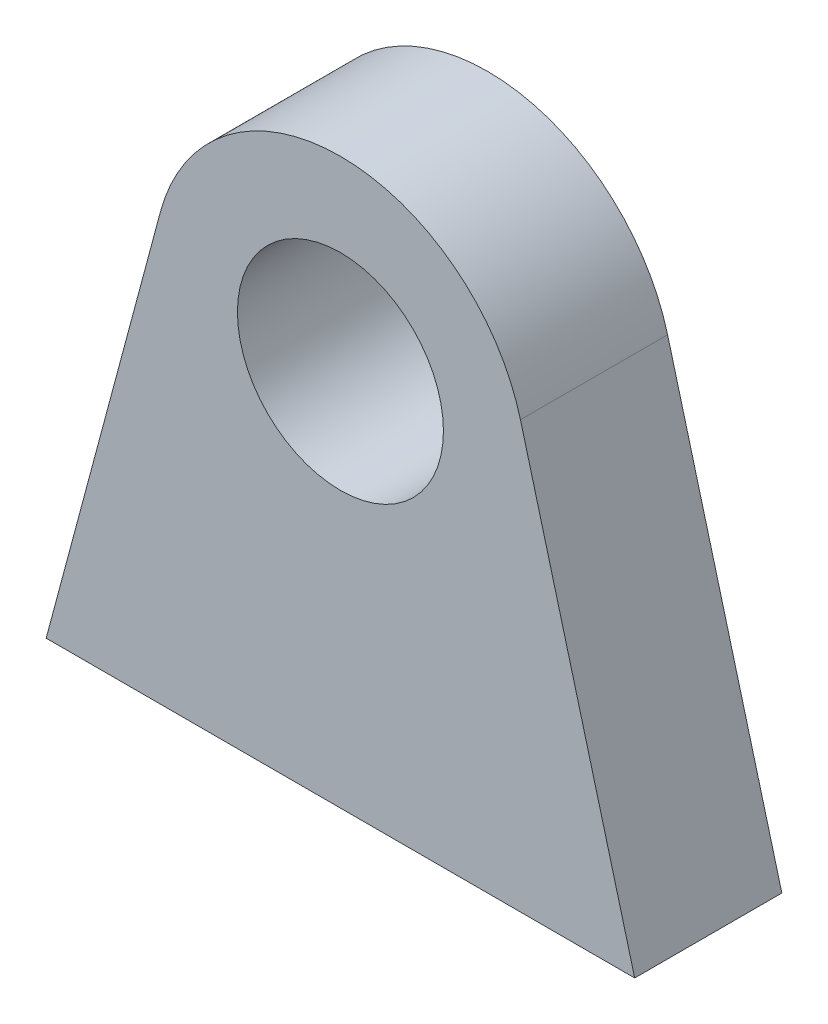
ISO-10303-21;
HEADER;
FILE_DESCRIPTION(('STEP AP214'),'2;1');
FILE_NAME('part.step','',(''),(''),'','','');
FILE_SCHEMA(('AUTOMOTIVE_DESIGN { 1 0 10303 214 1 1 1 1 }'));
ENDSEC;
DATA;
#1=APPLICATION_CONTEXT('core data for automotive mechanical design processes');
#2=APPLICATION_PROTOCOL_DEFINITION('international standard','automotive_design',2000,#1);
#3=PRODUCT_CONTEXT('',#1,'mechanical');
#4=PRODUCT('Part','Part','',(#3));
#5=PRODUCT_RELATED_PRODUCT_CATEGORY('part','',(#4));
#6=PRODUCT_DEFINITION_FORMATION('','',#4);
#7=PRODUCT_DEFINITION_CONTEXT('part definition',#1,'design');
#8=PRODUCT_DEFINITION('design','',#6,#7);
#9=PRODUCT_DEFINITION_SHAPE('','',#8);
#10=(LENGTH_UNIT() NAMED_UNIT(*) SI_UNIT(.MILLI.,.METRE.));
#11=(NAMED_UNIT(*) PLANE_ANGLE_UNIT() SI_UNIT($,.RADIAN.));
#12=(NAMED_UNIT(*) SI_UNIT($,.STERADIAN.) SOLID_ANGLE_UNIT());
#13=UNCERTAINTY_MEASURE_WITH_UNIT(LENGTH_MEASURE(1.E-05),#10,'distance_accuracy_value','');
#14=(GEOMETRIC_REPRESENTATION_CONTEXT(3) GLOBAL_UNCERTAINTY_ASSIGNED_CONTEXT((#13)) GLOBAL_UNIT_ASSIGNED_CONTEXT((#10,
#11,#12)) REPRESENTATION_CONTEXT('',''));
#15=CARTESIAN_POINT('',(0.,0.,0.));
#16=DIRECTION('',(0.,0.,1.));
#17=DIRECTION('',(1.,0.,0.));
#18=AXIS2_PLACEMENT_3D('',#15,#16,#17);
#19=CARTESIAN_POINT('',(-20.,0.,10.));
#20=DIRECTION('',(0.965925826289069,-0.258819045102518,0.));
#21=DIRECTION('',(0.258819045102518,0.965925826289069,0.));
#22=AXIS2_PLACEMENT_3D('',#19,#20,#21);
#23=PLANE('',#22);
#24=DIRECTION('',(-0.258819045102518,-0.965925826289069,0.));
#25=VECTOR('',#24,1.);
#26=CARTESIAN_POINT('',(-20.,0.,0.));
#27=LINE('',#26,#25);
#28=CARTESIAN_POINT('',(-12.2354286469245,28.9777747886721,0.));
#29=VERTEX_POINT('',#28);
#30=CARTESIAN_POINT('',(-20.,0.,0.));
#31=VERTEX_POINT('',#30);
#32=EDGE_CURVE('E112',#29,#31,#27,.T.);
#33=ORIENTED_EDGE('',*,*,#32,.T.);
#34=DIRECTION('',(0.,0.,-1.));
#35=VECTOR('',#34,1.);
#36=CARTESIAN_POINT('',(-20.,0.,10.));
#37=LINE('',#36,#35);
#38=CARTESIAN_POINT('',(-20.,0.,10.));
#39=VERTEX_POINT('',#38);
#40=EDGE_CURVE('E11',#39,#31,#37,.T.);
#41=ORIENTED_EDGE('',*,*,#40,.F.);
#42=DIRECTION('',(-0.258819045102518,-0.965925826289069,0.));
#43=VECTOR('',#42,1.);
#44=CARTESIAN_POINT('',(-20.,0.,10.));
#45=LINE('',#44,#43);
#46=CARTESIAN_POINT('',(-12.2354286469245,28.9777747886721,10.));
#47=VERTEX_POINT('',#46);
#48=EDGE_CURVE('E95',#47,#39,#45,.T.);
#49=ORIENTED_EDGE('',*,*,#48,.F.);
#50=DIRECTION('',(0.,0.,-1.));
#51=VECTOR('',#50,1.);
#52=CARTESIAN_POINT('',(-12.2354286469245,28.9777747886721,10.));
#53=LINE('',#52,#51);
#54=EDGE_CURVE('E108',#47,#29,#53,.T.);
#55=ORIENTED_EDGE('',*,*,#54,.T.);
#56=EDGE_LOOP('',(#33,#41,#49,#55));
#57=FACE_BOUND('',#56,.T.);
#58=ADVANCED_FACE('F43',(#57),#23,.F.);
#59=CARTESIAN_POINT('',(-20.,0.,10.));
#60=DIRECTION('',(0.,1.,0.));
#61=DIRECTION('',(-1.,0.,0.));
#62=AXIS2_PLACEMENT_3D('',#59,#60,#61);
#63=PLANE('',#62);
#64=DIRECTION('',(1.,0.,0.));
#65=VECTOR('',#64,1.);
#66=CARTESIAN_POINT('',(-20.,0.,0.));
#67=LINE('',#66,#65);
#68=CARTESIAN_POINT('',(20.,0.,0.));
#69=VERTEX_POINT('',#68);
#70=EDGE_CURVE('E100',#31,#69,#67,.T.);
#71=ORIENTED_EDGE('',*,*,#70,.T.);
#72=DIRECTION('',(0.,0.,-1.));
#73=VECTOR('',#72,1.);
#74=CARTESIAN_POINT('',(20.,0.,10.));
#75=LINE('',#74,#73);
#76=CARTESIAN_POINT('',(20.,0.,10.));
#77=VERTEX_POINT('',#76);
#78=EDGE_CURVE('E52',#77,#69,#75,.T.);
#79=ORIENTED_EDGE('',*,*,#78,.F.);
#80=DIRECTION('',(1.,0.,0.));
#81=VECTOR('',#80,1.);
#82=CARTESIAN_POINT('',(-20.,0.,10.));
#83=LINE('',#82,#81);
#84=EDGE_CURVE('E90',#39,#77,#83,.T.);
#85=ORIENTED_EDGE('',*,*,#84,.F.);
#86=ORIENTED_EDGE('',*,*,#40,.T.);
#87=EDGE_LOOP('',(#71,#79,#85,#86));
#88=FACE_BOUND('',#87,.T.);
#89=ADVANCED_FACE('F99',(#88),#63,.F.);
#90=CARTESIAN_POINT('',(20.,0.,10.));
#91=DIRECTION('',(-0.965925826289069,-0.258819045102518,0.));
#92=DIRECTION('',(0.258819045102518,-0.965925826289069,0.));
#93=AXIS2_PLACEMENT_3D('',#90,#91,#92);
#94=PLANE('',#93);
#95=DIRECTION('',(-0.258819045102518,0.965925826289069,0.));
#96=VECTOR('',#95,1.);
#97=CARTESIAN_POINT('',(20.,0.,0.));
#98=LINE('',#97,#96);
#99=CARTESIAN_POINT('',(12.2354286469245,28.9777747886721,0.));
#100=VERTEX_POINT('',#99);
#101=EDGE_CURVE('E77',#69,#100,#98,.T.);
#102=ORIENTED_EDGE('',*,*,#101,.T.);
#103=DIRECTION('',(0.,0.,-1.));
#104=VECTOR('',#103,1.);
#105=CARTESIAN_POINT('',(12.2354286469245,28.9777747886721,10.));
#106=LINE('',#105,#104);
#107=CARTESIAN_POINT('',(12.2354286469245,28.9777747886721,10.));
#108=VERTEX_POINT('',#107);
#109=EDGE_CURVE('E102',#108,#100,#106,.T.);
#110=ORIENTED_EDGE('',*,*,#109,.F.);
#111=DIRECTION('',(-0.258819045102518,0.965925826289069,0.));
#112=VECTOR('',#111,1.);
#113=CARTESIAN_POINT('',(20.,0.,10.));
#114=LINE('',#113,#112);
#115=EDGE_CURVE('E93',#77,#108,#114,.T.);
#116=ORIENTED_EDGE('',*,*,#115,.F.);
#117=ORIENTED_EDGE('',*,*,#78,.T.);
#118=EDGE_LOOP('',(#102,#110,#116,#117));
#119=FACE_BOUND('',#118,.T.);
#120=ADVANCED_FACE('F103',(#119),#94,.F.);
#121=CARTESIAN_POINT('',(0.,25.6993015636801,10.));
#122=DIRECTION('',(0.,0.,-1.));
#123=DIRECTION('',(-1.,0.,0.));
#124=AXIS2_PLACEMENT_3D('',#121,#122,#123);
#125=CYLINDRICAL_SURFACE('',#124,12.6670478352681);
#126=CARTESIAN_POINT('',(0.,25.6993015636801,0.));
#127=DIRECTION('',(0.,0.,1.));
#128=DIRECTION('',(-1.,0.,0.));
#129=AXIS2_PLACEMENT_3D('',#126,#127,#128);
#130=CIRCLE('',#129,12.6670478352681);
#131=EDGE_CURVE('E83',#100,#29,#130,.T.);
#132=ORIENTED_EDGE('',*,*,#131,.T.);
#133=ORIENTED_EDGE('',*,*,#54,.F.);
#134=CARTESIAN_POINT('',(0.,25.6993015636801,10.));
#135=DIRECTION('',(0.,0.,1.));
#136=DIRECTION('',(-1.,0.,0.));
#137=AXIS2_PLACEMENT_3D('',#134,#135,#136);
#138=CIRCLE('',#137,12.6670478352681);
#139=EDGE_CURVE('E60',#108,#47,#138,.T.);
#140=ORIENTED_EDGE('',*,*,#139,.F.);
#141=ORIENTED_EDGE('',*,*,#109,.T.);
#142=EDGE_LOOP('',(#132,#133,#140,#141));
#143=FACE_BOUND('',#142,.T.);
#144=ADVANCED_FACE('F127',(#143),#125,.T.);
#145=CARTESIAN_POINT('',(0.,25.6993015636801,10.));
#146=DIRECTION('',(0.,0.,-1.));
#147=DIRECTION('',(-1.,0.,0.));
#148=AXIS2_PLACEMENT_3D('',#145,#146,#147);
#149=PLANE('',#148);
#150=CARTESIAN_POINT('',(0.,25.6993015636801,10.));
#151=DIRECTION('',(0.,0.,1.));
#152=DIRECTION('',(1.,0.,0.));
#153=AXIS2_PLACEMENT_3D('',#150,#151,#152);
#154=CIRCLE('',#153,7.);
#155=CARTESIAN_POINT('',(7.,25.6993015636801,10.));
#156=VERTEX_POINT('',#155);
#157=EDGE_CURVE('E116',#156,#156,#154,.T.);
#158=ORIENTED_EDGE('',*,*,#157,.F.);
#159=EDGE_LOOP('',(#158));
#160=FACE_BOUND('',#159,.T.);
#161=ORIENTED_EDGE('',*,*,#48,.T.);
#162=ORIENTED_EDGE('',*,*,#84,.T.);
#163=ORIENTED_EDGE('',*,*,#115,.T.);
#164=ORIENTED_EDGE('',*,*,#139,.T.);
#165=EDGE_LOOP('',(#161,#162,#163,#164));
#166=FACE_BOUND('',#165,.T.);
#167=ADVANCED_FACE('F91',(#160,#166),#149,.F.);
#168=CARTESIAN_POINT('',(0.,25.6993015636801,0.));
#169=DIRECTION('',(0.,0.,-1.));
#170=DIRECTION('',(-1.,0.,0.));
#171=AXIS2_PLACEMENT_3D('',#168,#169,#170);
#172=PLANE('',#171);
#173=CARTESIAN_POINT('',(0.,25.6993015636801,0.));
#174=DIRECTION('',(0.,0.,1.));
#175=DIRECTION('',(1.,0.,0.));
#176=AXIS2_PLACEMENT_3D('',#173,#174,#175);
#177=CIRCLE('',#176,7.);
#178=CARTESIAN_POINT('',(7.,25.6993015636801,0.));
#179=VERTEX_POINT('',#178);
#180=EDGE_CURVE('E135',#179,#179,#177,.T.);
#181=ORIENTED_EDGE('',*,*,#180,.T.);
#182=EDGE_LOOP('',(#181));
#183=FACE_BOUND('',#182,.T.);
#184=ORIENTED_EDGE('',*,*,#32,.F.);
#185=ORIENTED_EDGE('',*,*,#131,.F.);
#186=ORIENTED_EDGE('',*,*,#101,.F.);
#187=ORIENTED_EDGE('',*,*,#70,.F.);
#188=EDGE_LOOP('',(#184,#185,#186,#187));
#189=FACE_BOUND('',#188,.T.);
#190=ADVANCED_FACE('F130',(#183,#189),#172,.T.);
#191=CARTESIAN_POINT('',(0.,25.6993015636801,10.));
#192=DIRECTION('',(0.,0.,-1.));
#193=DIRECTION('',(-1.,0.,0.));
#194=AXIS2_PLACEMENT_3D('',#191,#192,#193);
#195=CYLINDRICAL_SURFACE('',#194,7.);
#196=ORIENTED_EDGE('',*,*,#157,.T.);
#197=EDGE_LOOP('',(#196));
#198=FACE_BOUND('',#197,.T.);
#199=ORIENTED_EDGE('',*,*,#180,.F.);
#200=EDGE_LOOP('',(#199));
#201=FACE_BOUND('',#200,.T.);
#202=ADVANCED_FACE('F144',(#198,#201),#195,.F.);
#203=CLOSED_SHELL('',(#58,#89,#120,#144,#167,#190,#202));
#204=MANIFOLD_SOLID_BREP('B2',#203);
#205=ADVANCED_BREP_SHAPE_REPRESENTATION('',(#18,#204),#14);
#206=SHAPE_DEFINITION_REPRESENTATION(#9,#205);
ENDSEC;
END-ISO-10303-21;
